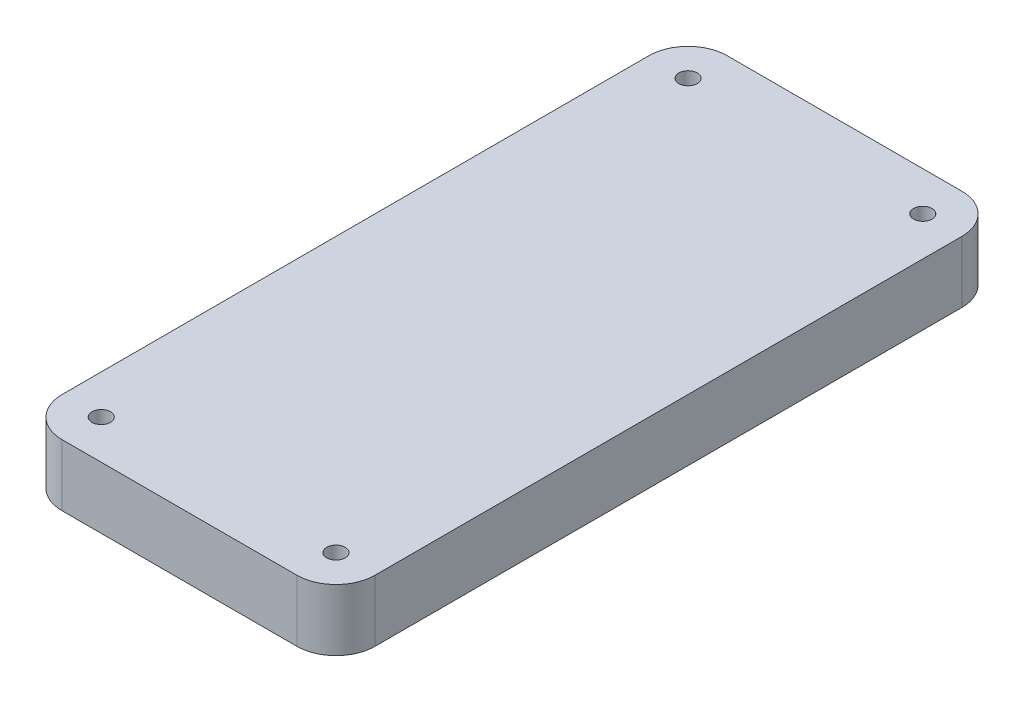
ISO-10303-21;
HEADER;
FILE_DESCRIPTION(('STEP AP214'),'2;1');
FILE_NAME('part.step','',(''),(''),'','','');
FILE_SCHEMA(('AUTOMOTIVE_DESIGN { 1 0 10303 214 1 1 1 1 }'));
ENDSEC;
DATA;
#1=APPLICATION_CONTEXT('core data for automotive mechanical design processes');
#2=APPLICATION_PROTOCOL_DEFINITION('international standard','automotive_design',2000,#1);
#3=PRODUCT_CONTEXT('',#1,'mechanical');
#4=PRODUCT('Part','Part','',(#3));
#5=PRODUCT_RELATED_PRODUCT_CATEGORY('part','',(#4));
#6=PRODUCT_DEFINITION_FORMATION('','',#4);
#7=PRODUCT_DEFINITION_CONTEXT('part definition',#1,'design');
#8=PRODUCT_DEFINITION('design','',#6,#7);
#9=PRODUCT_DEFINITION_SHAPE('','',#8);
#10=(LENGTH_UNIT() NAMED_UNIT(*) SI_UNIT(.MILLI.,.METRE.));
#11=(NAMED_UNIT(*) PLANE_ANGLE_UNIT() SI_UNIT($,.RADIAN.));
#12=(NAMED_UNIT(*) SI_UNIT($,.STERADIAN.) SOLID_ANGLE_UNIT());
#13=UNCERTAINTY_MEASURE_WITH_UNIT(LENGTH_MEASURE(1.E-05),#10,'distance_accuracy_value','');
#14=(GEOMETRIC_REPRESENTATION_CONTEXT(3) GLOBAL_UNCERTAINTY_ASSIGNED_CONTEXT((#13)) GLOBAL_UNIT_ASSIGNED_CONTEXT((#10,
#11,#12)) REPRESENTATION_CONTEXT('',''));
#15=CARTESIAN_POINT('',(0.,0.,0.));
#16=DIRECTION('',(0.,0.,1.));
#17=DIRECTION('',(1.,0.,0.));
#18=AXIS2_PLACEMENT_3D('',#15,#16,#17);
#19=CARTESIAN_POINT('',(0.,20.,0.));
#20=DIRECTION('',(1.,0.,0.));
#21=DIRECTION('',(0.,0.,-1.));
#22=AXIS2_PLACEMENT_3D('',#19,#20,#21);
#23=PLANE('',#22);
#24=DIRECTION('',(0.,0.,1.));
#25=VECTOR('',#24,1.);
#26=CARTESIAN_POINT('',(0.,20.,0.));
#27=LINE('',#26,#25);
#28=CARTESIAN_POINT('',(0.,20.,-203.2));
#29=VERTEX_POINT('',#28);
#30=CARTESIAN_POINT('',(0.,20.,-12.7));
#31=VERTEX_POINT('',#30);
#32=EDGE_CURVE('E132',#29,#31,#27,.T.);
#33=ORIENTED_EDGE('',*,*,#32,.F.);
#34=DIRECTION('',(0.,-1.,0.));
#35=VECTOR('',#34,1.);
#36=CARTESIAN_POINT('',(0.,20.,-203.2));
#37=LINE('',#36,#35);
#38=CARTESIAN_POINT('',(0.,0.,-203.2));
#39=VERTEX_POINT('',#38);
#40=EDGE_CURVE('E116',#29,#39,#37,.T.);
#41=ORIENTED_EDGE('',*,*,#40,.T.);
#42=DIRECTION('',(0.,0.,1.));
#43=VECTOR('',#42,1.);
#44=CARTESIAN_POINT('',(0.,0.,0.));
#45=LINE('',#44,#43);
#46=CARTESIAN_POINT('',(0.,0.,-12.7));
#47=VERTEX_POINT('',#46);
#48=EDGE_CURVE('E129',#39,#47,#45,.T.);
#49=ORIENTED_EDGE('',*,*,#48,.T.);
#50=DIRECTION('',(0.,-1.,0.));
#51=VECTOR('',#50,1.);
#52=CARTESIAN_POINT('',(0.,20.,-12.7));
#53=LINE('',#52,#51);
#54=EDGE_CURVE('E135',#47,#31,#53,.F.);
#55=ORIENTED_EDGE('',*,*,#54,.T.);
#56=EDGE_LOOP('',(#33,#41,#49,#55));
#57=FACE_BOUND('',#56,.T.);
#58=ADVANCED_FACE('F44',(#57),#23,.F.);
#59=CARTESIAN_POINT('',(0.,20.,0.));
#60=DIRECTION('',(0.,0.,-1.));
#61=DIRECTION('',(-1.,0.,0.));
#62=AXIS2_PLACEMENT_3D('',#59,#60,#61);
#63=PLANE('',#62);
#64=DIRECTION('',(1.,0.,0.));
#65=VECTOR('',#64,1.);
#66=CARTESIAN_POINT('',(0.,20.,0.));
#67=LINE('',#66,#65);
#68=CARTESIAN_POINT('',(12.7,20.,0.));
#69=VERTEX_POINT('',#68);
#70=CARTESIAN_POINT('',(88.9,20.,0.));
#71=VERTEX_POINT('',#70);
#72=EDGE_CURVE('E196',#69,#71,#67,.T.);
#73=ORIENTED_EDGE('',*,*,#72,.F.);
#74=DIRECTION('',(0.,-1.,0.));
#75=VECTOR('',#74,1.);
#76=CARTESIAN_POINT('',(12.7,20.,0.));
#77=LINE('',#76,#75);
#78=CARTESIAN_POINT('',(12.7,0.,0.));
#79=VERTEX_POINT('',#78);
#80=EDGE_CURVE('E12',#69,#79,#77,.T.);
#81=ORIENTED_EDGE('',*,*,#80,.T.);
#82=DIRECTION('',(1.,0.,0.));
#83=VECTOR('',#82,1.);
#84=CARTESIAN_POINT('',(0.,0.,0.));
#85=LINE('',#84,#83);
#86=CARTESIAN_POINT('',(88.9,0.,0.));
#87=VERTEX_POINT('',#86);
#88=EDGE_CURVE('E141',#79,#87,#85,.T.);
#89=ORIENTED_EDGE('',*,*,#88,.T.);
#90=DIRECTION('',(0.,-1.,0.));
#91=VECTOR('',#90,1.);
#92=CARTESIAN_POINT('',(88.9,20.,0.));
#93=LINE('',#92,#91);
#94=EDGE_CURVE('E53',#87,#71,#93,.F.);
#95=ORIENTED_EDGE('',*,*,#94,.T.);
#96=EDGE_LOOP('',(#73,#81,#89,#95));
#97=FACE_BOUND('',#96,.T.);
#98=ADVANCED_FACE('F195',(#97),#63,.F.);
#99=CARTESIAN_POINT('',(101.6,20.,0.));
#100=DIRECTION('',(-1.,0.,0.));
#101=DIRECTION('',(0.,0.,1.));
#102=AXIS2_PLACEMENT_3D('',#99,#100,#101);
#103=PLANE('',#102);
#104=DIRECTION('',(0.,0.,-1.));
#105=VECTOR('',#104,1.);
#106=CARTESIAN_POINT('',(101.6,0.,0.));
#107=LINE('',#106,#105);
#108=CARTESIAN_POINT('',(101.6,0.,-12.7));
#109=VERTEX_POINT('',#108);
#110=CARTESIAN_POINT('',(101.6,0.,-203.2));
#111=VERTEX_POINT('',#110);
#112=EDGE_CURVE('E147',#109,#111,#107,.T.);
#113=ORIENTED_EDGE('',*,*,#112,.T.);
#114=DIRECTION('',(0.,-1.,0.));
#115=VECTOR('',#114,1.);
#116=CARTESIAN_POINT('',(101.6,20.,-203.2));
#117=LINE('',#116,#115);
#118=CARTESIAN_POINT('',(101.6,20.,-203.2));
#119=VERTEX_POINT('',#118);
#120=EDGE_CURVE('E60',#111,#119,#117,.F.);
#121=ORIENTED_EDGE('',*,*,#120,.T.);
#122=DIRECTION('',(0.,0.,-1.));
#123=VECTOR('',#122,1.);
#124=CARTESIAN_POINT('',(101.6,20.,0.));
#125=LINE('',#124,#123);
#126=CARTESIAN_POINT('',(101.6,20.,-12.7));
#127=VERTEX_POINT('',#126);
#128=EDGE_CURVE('E203',#127,#119,#125,.T.);
#129=ORIENTED_EDGE('',*,*,#128,.F.);
#130=DIRECTION('',(0.,-1.,0.));
#131=VECTOR('',#130,1.);
#132=CARTESIAN_POINT('',(101.6,20.,-12.7));
#133=LINE('',#132,#131);
#134=EDGE_CURVE('E186',#127,#109,#133,.T.);
#135=ORIENTED_EDGE('',*,*,#134,.T.);
#136=EDGE_LOOP('',(#113,#121,#129,#135));
#137=FACE_BOUND('',#136,.T.);
#138=ADVANCED_FACE('F207',(#137),#103,.F.);
#139=CARTESIAN_POINT('',(0.,20.,-215.9));
#140=DIRECTION('',(0.,0.,1.));
#141=DIRECTION('',(1.,0.,0.));
#142=AXIS2_PLACEMENT_3D('',#139,#140,#141);
#143=PLANE('',#142);
#144=DIRECTION('',(-1.,0.,0.));
#145=VECTOR('',#144,1.);
#146=CARTESIAN_POINT('',(0.,0.,-215.9));
#147=LINE('',#146,#145);
#148=CARTESIAN_POINT('',(88.9,0.,-215.9));
#149=VERTEX_POINT('',#148);
#150=CARTESIAN_POINT('',(12.7,0.,-215.9));
#151=VERTEX_POINT('',#150);
#152=EDGE_CURVE('E209',#149,#151,#147,.T.);
#153=ORIENTED_EDGE('',*,*,#152,.T.);
#154=DIRECTION('',(0.,-1.,0.));
#155=VECTOR('',#154,1.);
#156=CARTESIAN_POINT('',(12.7,20.,-215.9));
#157=LINE('',#156,#155);
#158=CARTESIAN_POINT('',(12.7,20.,-215.9));
#159=VERTEX_POINT('',#158);
#160=EDGE_CURVE('E117',#151,#159,#157,.F.);
#161=ORIENTED_EDGE('',*,*,#160,.T.);
#162=DIRECTION('',(-1.,0.,0.));
#163=VECTOR('',#162,1.);
#164=CARTESIAN_POINT('',(0.,20.,-215.9));
#165=LINE('',#164,#163);
#166=CARTESIAN_POINT('',(88.9,20.,-215.9));
#167=VERTEX_POINT('',#166);
#168=EDGE_CURVE('E154',#167,#159,#165,.T.);
#169=ORIENTED_EDGE('',*,*,#168,.F.);
#170=DIRECTION('',(0.,-1.,0.));
#171=VECTOR('',#170,1.);
#172=CARTESIAN_POINT('',(88.9,20.,-215.9));
#173=LINE('',#172,#171);
#174=EDGE_CURVE('E123',#167,#149,#173,.T.);
#175=ORIENTED_EDGE('',*,*,#174,.T.);
#176=EDGE_LOOP('',(#153,#161,#169,#175));
#177=FACE_BOUND('',#176,.T.);
#178=ADVANCED_FACE('F326',(#177),#143,.F.);
#179=CARTESIAN_POINT('',(0.,20.,0.));
#180=DIRECTION('',(0.,-1.,0.));
#181=DIRECTION('',(0.,0.,-1.));
#182=AXIS2_PLACEMENT_3D('',#179,#180,#181);
#183=PLANE('',#182);
#184=CARTESIAN_POINT('',(12.7,20.,-203.2));
#185=DIRECTION('',(0.,-1.,0.));
#186=DIRECTION('',(0.,0.,-1.));
#187=AXIS2_PLACEMENT_3D('',#184,#185,#186);
#188=CIRCLE('',#187,3.);
#189=CARTESIAN_POINT('',(12.7,20.,-206.2));
#190=VERTEX_POINT('',#189);
#191=EDGE_CURVE('E230',#190,#190,#188,.T.);
#192=ORIENTED_EDGE('',*,*,#191,.T.);
#193=EDGE_LOOP('',(#192));
#194=FACE_BOUND('',#193,.T.);
#195=CARTESIAN_POINT('',(88.9,20.,-12.7));
#196=DIRECTION('',(0.,-1.,0.));
#197=DIRECTION('',(0.,0.,-1.));
#198=AXIS2_PLACEMENT_3D('',#195,#196,#197);
#199=CIRCLE('',#198,3.00000000000001);
#200=CARTESIAN_POINT('',(88.9,20.,-15.7));
#201=VERTEX_POINT('',#200);
#202=EDGE_CURVE('E237',#201,#201,#199,.T.);
#203=ORIENTED_EDGE('',*,*,#202,.T.);
#204=EDGE_LOOP('',(#203));
#205=FACE_BOUND('',#204,.T.);
#206=CARTESIAN_POINT('',(12.7,20.,-12.7));
#207=DIRECTION('',(0.,-1.,0.));
#208=DIRECTION('',(0.,0.,-1.));
#209=AXIS2_PLACEMENT_3D('',#206,#207,#208);
#210=CIRCLE('',#209,3.);
#211=CARTESIAN_POINT('',(12.7,20.,-15.7));
#212=VERTEX_POINT('',#211);
#213=EDGE_CURVE('E238',#212,#212,#210,.T.);
#214=ORIENTED_EDGE('',*,*,#213,.T.);
#215=EDGE_LOOP('',(#214));
#216=FACE_BOUND('',#215,.T.);
#217=CARTESIAN_POINT('',(88.9,20.,-203.2));
#218=DIRECTION('',(0.,-1.,0.));
#219=DIRECTION('',(0.,0.,-1.));
#220=AXIS2_PLACEMENT_3D('',#217,#218,#219);
#221=CIRCLE('',#220,3.00000000000001);
#222=CARTESIAN_POINT('',(88.9,20.,-206.2));
#223=VERTEX_POINT('',#222);
#224=EDGE_CURVE('E142',#223,#223,#221,.T.);
#225=ORIENTED_EDGE('',*,*,#224,.T.);
#226=EDGE_LOOP('',(#225));
#227=FACE_BOUND('',#226,.T.);
#228=ORIENTED_EDGE('',*,*,#168,.T.);
#229=CARTESIAN_POINT('',(12.7,20.,-203.2));
#230=DIRECTION('',(0.,-1.,0.));
#231=DIRECTION('',(0.,0.,-1.));
#232=AXIS2_PLACEMENT_3D('',#229,#230,#231);
#233=CIRCLE('',#232,12.7);
#234=EDGE_CURVE('E183',#159,#29,#233,.F.);
#235=ORIENTED_EDGE('',*,*,#234,.T.);
#236=ORIENTED_EDGE('',*,*,#32,.T.);
#237=CARTESIAN_POINT('',(12.7,20.,-12.7));
#238=DIRECTION('',(0.,-1.,0.));
#239=DIRECTION('',(0.,0.,-1.));
#240=AXIS2_PLACEMENT_3D('',#237,#238,#239);
#241=CIRCLE('',#240,12.7);
#242=EDGE_CURVE('E177',#31,#69,#241,.F.);
#243=ORIENTED_EDGE('',*,*,#242,.T.);
#244=ORIENTED_EDGE('',*,*,#72,.T.);
#245=CARTESIAN_POINT('',(88.9,20.,-12.7));
#246=DIRECTION('',(0.,-1.,0.));
#247=DIRECTION('',(0.,0.,-1.));
#248=AXIS2_PLACEMENT_3D('',#245,#246,#247);
#249=CIRCLE('',#248,12.7);
#250=EDGE_CURVE('E67',#71,#127,#249,.F.);
#251=ORIENTED_EDGE('',*,*,#250,.T.);
#252=ORIENTED_EDGE('',*,*,#128,.T.);
#253=CARTESIAN_POINT('',(88.9,20.,-203.2));
#254=DIRECTION('',(0.,-1.,0.));
#255=DIRECTION('',(0.,0.,-1.));
#256=AXIS2_PLACEMENT_3D('',#253,#254,#255);
#257=CIRCLE('',#256,12.7);
#258=EDGE_CURVE('E180',#119,#167,#257,.F.);
#259=ORIENTED_EDGE('',*,*,#258,.T.);
#260=EDGE_LOOP('',(#228,#235,#236,#243,#244,#251,#252,#259));
#261=FACE_BOUND('',#260,.T.);
#262=ADVANCED_FACE('F200',(#194,#205,#216,#227,#261),#183,.F.);
#263=CARTESIAN_POINT('',(0.,0.,0.));
#264=DIRECTION('',(0.,-1.,0.));
#265=DIRECTION('',(0.,0.,-1.));
#266=AXIS2_PLACEMENT_3D('',#263,#264,#265);
#267=PLANE('',#266);
#268=CARTESIAN_POINT('',(12.7,0.,-203.2));
#269=DIRECTION('',(0.,-1.,0.));
#270=DIRECTION('',(0.,0.,-1.));
#271=AXIS2_PLACEMENT_3D('',#268,#269,#270);
#272=CIRCLE('',#271,3.);
#273=CARTESIAN_POINT('',(12.7,0.,-206.2));
#274=VERTEX_POINT('',#273);
#275=EDGE_CURVE('E251',#274,#274,#272,.T.);
#276=ORIENTED_EDGE('',*,*,#275,.F.);
#277=EDGE_LOOP('',(#276));
#278=FACE_BOUND('',#277,.T.);
#279=CARTESIAN_POINT('',(88.9,0.,-12.7));
#280=DIRECTION('',(0.,-1.,0.));
#281=DIRECTION('',(0.,0.,-1.));
#282=AXIS2_PLACEMENT_3D('',#279,#280,#281);
#283=CIRCLE('',#282,3.00000000000001);
#284=CARTESIAN_POINT('',(88.9,0.,-15.7));
#285=VERTEX_POINT('',#284);
#286=EDGE_CURVE('E232',#285,#285,#283,.T.);
#287=ORIENTED_EDGE('',*,*,#286,.F.);
#288=EDGE_LOOP('',(#287));
#289=FACE_BOUND('',#288,.T.);
#290=CARTESIAN_POINT('',(12.7,0.,-12.7));
#291=DIRECTION('',(0.,-1.,0.));
#292=DIRECTION('',(0.,0.,-1.));
#293=AXIS2_PLACEMENT_3D('',#290,#291,#292);
#294=CIRCLE('',#293,3.);
#295=CARTESIAN_POINT('',(12.7,0.,-15.7));
#296=VERTEX_POINT('',#295);
#297=EDGE_CURVE('E243',#296,#296,#294,.T.);
#298=ORIENTED_EDGE('',*,*,#297,.F.);
#299=EDGE_LOOP('',(#298));
#300=FACE_BOUND('',#299,.T.);
#301=CARTESIAN_POINT('',(88.9,0.,-203.2));
#302=DIRECTION('',(0.,-1.,0.));
#303=DIRECTION('',(0.,0.,-1.));
#304=AXIS2_PLACEMENT_3D('',#301,#302,#303);
#305=CIRCLE('',#304,3.00000000000001);
#306=CARTESIAN_POINT('',(88.9,0.,-206.2));
#307=VERTEX_POINT('',#306);
#308=EDGE_CURVE('E150',#307,#307,#305,.T.);
#309=ORIENTED_EDGE('',*,*,#308,.F.);
#310=EDGE_LOOP('',(#309));
#311=FACE_BOUND('',#310,.T.);
#312=ORIENTED_EDGE('',*,*,#48,.F.);
#313=CARTESIAN_POINT('',(12.7,0.,-203.2));
#314=DIRECTION('',(0.,-1.,0.));
#315=DIRECTION('',(0.,0.,-1.));
#316=AXIS2_PLACEMENT_3D('',#313,#314,#315);
#317=CIRCLE('',#316,12.7);
#318=EDGE_CURVE('E112',#39,#151,#317,.T.);
#319=ORIENTED_EDGE('',*,*,#318,.T.);
#320=ORIENTED_EDGE('',*,*,#152,.F.);
#321=CARTESIAN_POINT('',(88.9,0.,-203.2));
#322=DIRECTION('',(0.,-1.,0.));
#323=DIRECTION('',(0.,0.,-1.));
#324=AXIS2_PLACEMENT_3D('',#321,#322,#323);
#325=CIRCLE('',#324,12.7);
#326=EDGE_CURVE('E124',#149,#111,#325,.T.);
#327=ORIENTED_EDGE('',*,*,#326,.T.);
#328=ORIENTED_EDGE('',*,*,#112,.F.);
#329=CARTESIAN_POINT('',(88.9,0.,-12.7));
#330=DIRECTION('',(0.,-1.,0.));
#331=DIRECTION('',(0.,0.,-1.));
#332=AXIS2_PLACEMENT_3D('',#329,#330,#331);
#333=CIRCLE('',#332,12.7);
#334=EDGE_CURVE('E134',#109,#87,#333,.T.);
#335=ORIENTED_EDGE('',*,*,#334,.T.);
#336=ORIENTED_EDGE('',*,*,#88,.F.);
#337=CARTESIAN_POINT('',(12.7,0.,-12.7));
#338=DIRECTION('',(0.,-1.,0.));
#339=DIRECTION('',(0.,0.,-1.));
#340=AXIS2_PLACEMENT_3D('',#337,#338,#339);
#341=CIRCLE('',#340,12.7);
#342=EDGE_CURVE('E139',#79,#47,#341,.T.);
#343=ORIENTED_EDGE('',*,*,#342,.T.);
#344=EDGE_LOOP('',(#312,#319,#320,#327,#328,#335,#336,#343));
#345=FACE_BOUND('',#344,.T.);
#346=ADVANCED_FACE('F137',(#278,#289,#300,#311,#345),#267,.T.);
#347=CARTESIAN_POINT('',(12.7,20.,-203.2));
#348=DIRECTION('',(0.,-1.,0.));
#349=DIRECTION('',(0.,0.,-1.));
#350=AXIS2_PLACEMENT_3D('',#347,#348,#349);
#351=CYLINDRICAL_SURFACE('',#350,12.7);
#352=ORIENTED_EDGE('',*,*,#234,.F.);
#353=ORIENTED_EDGE('',*,*,#160,.F.);
#354=ORIENTED_EDGE('',*,*,#318,.F.);
#355=ORIENTED_EDGE('',*,*,#40,.F.);
#356=EDGE_LOOP('',(#352,#353,#354,#355));
#357=FACE_BOUND('',#356,.T.);
#358=ADVANCED_FACE('F115',(#357),#351,.T.);
#359=CARTESIAN_POINT('',(88.9,20.,-203.2));
#360=DIRECTION('',(0.,-1.,0.));
#361=DIRECTION('',(0.,0.,-1.));
#362=AXIS2_PLACEMENT_3D('',#359,#360,#361);
#363=CYLINDRICAL_SURFACE('',#362,12.7);
#364=ORIENTED_EDGE('',*,*,#258,.F.);
#365=ORIENTED_EDGE('',*,*,#120,.F.);
#366=ORIENTED_EDGE('',*,*,#326,.F.);
#367=ORIENTED_EDGE('',*,*,#174,.F.);
#368=EDGE_LOOP('',(#364,#365,#366,#367));
#369=FACE_BOUND('',#368,.T.);
#370=ADVANCED_FACE('F302',(#369),#363,.T.);
#371=CARTESIAN_POINT('',(12.7,20.,-12.7));
#372=DIRECTION('',(0.,-1.,0.));
#373=DIRECTION('',(0.,0.,-1.));
#374=AXIS2_PLACEMENT_3D('',#371,#372,#373);
#375=CYLINDRICAL_SURFACE('',#374,12.7);
#376=ORIENTED_EDGE('',*,*,#242,.F.);
#377=ORIENTED_EDGE('',*,*,#54,.F.);
#378=ORIENTED_EDGE('',*,*,#342,.F.);
#379=ORIENTED_EDGE('',*,*,#80,.F.);
#380=EDGE_LOOP('',(#376,#377,#378,#379));
#381=FACE_BOUND('',#380,.T.);
#382=ADVANCED_FACE('F289',(#381),#375,.T.);
#383=CARTESIAN_POINT('',(88.9,20.,-12.7));
#384=DIRECTION('',(0.,-1.,0.));
#385=DIRECTION('',(0.,0.,-1.));
#386=AXIS2_PLACEMENT_3D('',#383,#384,#385);
#387=CYLINDRICAL_SURFACE('',#386,12.7);
#388=ORIENTED_EDGE('',*,*,#250,.F.);
#389=ORIENTED_EDGE('',*,*,#94,.F.);
#390=ORIENTED_EDGE('',*,*,#334,.F.);
#391=ORIENTED_EDGE('',*,*,#134,.F.);
#392=EDGE_LOOP('',(#388,#389,#390,#391));
#393=FACE_BOUND('',#392,.T.);
#394=ADVANCED_FACE('F46',(#393),#387,.T.);
#395=CARTESIAN_POINT('',(88.9,20.,-203.2));
#396=DIRECTION('',(0.,-1.,0.));
#397=DIRECTION('',(0.,0.,-1.));
#398=AXIS2_PLACEMENT_3D('',#395,#396,#397);
#399=CYLINDRICAL_SURFACE('',#398,3.00000000000001);
#400=ORIENTED_EDGE('',*,*,#224,.F.);
#401=EDGE_LOOP('',(#400));
#402=FACE_BOUND('',#401,.T.);
#403=ORIENTED_EDGE('',*,*,#308,.T.);
#404=EDGE_LOOP('',(#403));
#405=FACE_BOUND('',#404,.T.);
#406=ADVANCED_FACE('F279',(#402,#405),#399,.F.);
#407=CARTESIAN_POINT('',(12.7,20.,-12.7));
#408=DIRECTION('',(0.,-1.,0.));
#409=DIRECTION('',(0.,0.,-1.));
#410=AXIS2_PLACEMENT_3D('',#407,#408,#409);
#411=CYLINDRICAL_SURFACE('',#410,3.);
#412=ORIENTED_EDGE('',*,*,#213,.F.);
#413=EDGE_LOOP('',(#412));
#414=FACE_BOUND('',#413,.T.);
#415=ORIENTED_EDGE('',*,*,#297,.T.);
#416=EDGE_LOOP('',(#415));
#417=FACE_BOUND('',#416,.T.);
#418=ADVANCED_FACE('F267',(#414,#417),#411,.F.);
#419=CARTESIAN_POINT('',(88.9,20.,-12.7));
#420=DIRECTION('',(0.,-1.,0.));
#421=DIRECTION('',(0.,0.,-1.));
#422=AXIS2_PLACEMENT_3D('',#419,#420,#421);
#423=CYLINDRICAL_SURFACE('',#422,3.00000000000001);
#424=ORIENTED_EDGE('',*,*,#202,.F.);
#425=EDGE_LOOP('',(#424));
#426=FACE_BOUND('',#425,.T.);
#427=ORIENTED_EDGE('',*,*,#286,.T.);
#428=EDGE_LOOP('',(#427));
#429=FACE_BOUND('',#428,.T.);
#430=ADVANCED_FACE('F263',(#426,#429),#423,.F.);
#431=CARTESIAN_POINT('',(12.7,20.,-203.2));
#432=DIRECTION('',(0.,-1.,0.));
#433=DIRECTION('',(0.,0.,-1.));
#434=AXIS2_PLACEMENT_3D('',#431,#432,#433);
#435=CYLINDRICAL_SURFACE('',#434,3.);
#436=ORIENTED_EDGE('',*,*,#191,.F.);
#437=EDGE_LOOP('',(#436));
#438=FACE_BOUND('',#437,.T.);
#439=ORIENTED_EDGE('',*,*,#275,.T.);
#440=EDGE_LOOP('',(#439));
#441=FACE_BOUND('',#440,.T.);
#442=ADVANCED_FACE('F266',(#438,#441),#435,.F.);
#443=CLOSED_SHELL('',(#58,#98,#138,#178,#262,#346,#358,#370,#382,#394,#406,#418,#430,#442));
#444=MANIFOLD_SOLID_BREP('B2',#443);
#445=ADVANCED_BREP_SHAPE_REPRESENTATION('',(#18,#444),#14);
#446=SHAPE_DEFINITION_REPRESENTATION(#9,#445);
ENDSEC;
END-ISO-10303-21;
